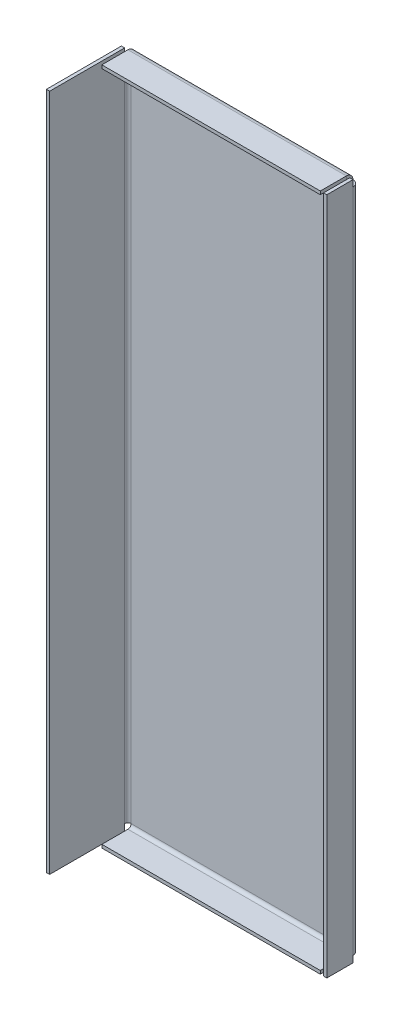
ISO-10303-21;
HEADER;
FILE_DESCRIPTION(('STEP AP214'),'2;1');
FILE_NAME('part.step','',(''),(''),'','','');
FILE_SCHEMA(('AUTOMOTIVE_DESIGN { 1 0 10303 214 1 1 1 1 }'));
ENDSEC;
DATA;
#1=APPLICATION_CONTEXT('core data for automotive mechanical design processes');
#2=APPLICATION_PROTOCOL_DEFINITION('international standard','automotive_design',2000,#1);
#3=PRODUCT_CONTEXT('',#1,'mechanical');
#4=PRODUCT('Part','Part','',(#3));
#5=PRODUCT_RELATED_PRODUCT_CATEGORY('part','',(#4));
#6=PRODUCT_DEFINITION_FORMATION('','',#4);
#7=PRODUCT_DEFINITION_CONTEXT('part definition',#1,'design');
#8=PRODUCT_DEFINITION('design','',#6,#7);
#9=PRODUCT_DEFINITION_SHAPE('','',#8);
#10=(LENGTH_UNIT() NAMED_UNIT(*) SI_UNIT(.MILLI.,.METRE.));
#11=(NAMED_UNIT(*) PLANE_ANGLE_UNIT() SI_UNIT($,.RADIAN.));
#12=(NAMED_UNIT(*) SI_UNIT($,.STERADIAN.) SOLID_ANGLE_UNIT());
#13=UNCERTAINTY_MEASURE_WITH_UNIT(LENGTH_MEASURE(1.E-05),#10,'distance_accuracy_value','');
#14=(GEOMETRIC_REPRESENTATION_CONTEXT(3) GLOBAL_UNCERTAINTY_ASSIGNED_CONTEXT((#13)) GLOBAL_UNIT_ASSIGNED_CONTEXT((#10,
#11,#12)) REPRESENTATION_CONTEXT('',''));
#15=CARTESIAN_POINT('',(0.,0.,0.));
#16=DIRECTION('',(0.,0.,1.));
#17=DIRECTION('',(1.,0.,0.));
#18=AXIS2_PLACEMENT_3D('',#15,#16,#17);
#19=CARTESIAN_POINT('',(0.,0.,-73.025));
#20=DIRECTION('',(0.,0.,-1.));
#21=DIRECTION('',(-1.,0.,0.));
#22=AXIS2_PLACEMENT_3D('',#19,#20,#21);
#23=PLANE('',#22);
#24=DIRECTION('',(-1.,0.,0.));
#25=VECTOR('',#24,1.);
#26=CARTESIAN_POINT('',(0.,6.34999999999997,-73.025));
#27=LINE('',#26,#25);
#28=CARTESIAN_POINT('',(0.,6.34999999999997,-73.025));
#29=VERTEX_POINT('',#28);
#30=CARTESIAN_POINT('',(-3.17500000000001,6.34999999999997,-73.025));
#31=VERTEX_POINT('',#30);
#32=EDGE_CURVE('E13',#29,#31,#27,.T.);
#33=ORIENTED_EDGE('',*,*,#32,.F.);
#34=DIRECTION('',(0.,1.,0.));
#35=VECTOR('',#34,1.);
#36=CARTESIAN_POINT('',(0.,660.4,-73.025));
#37=LINE('',#36,#35);
#38=CARTESIAN_POINT('',(0.,0.,-73.025));
#39=VERTEX_POINT('',#38);
#40=EDGE_CURVE('E449',#29,#39,#37,.F.);
#41=ORIENTED_EDGE('',*,*,#40,.T.);
#42=DIRECTION('',(-1.,0.,0.));
#43=VECTOR('',#42,1.);
#44=CARTESIAN_POINT('',(0.,0.,-73.025));
#45=LINE('',#44,#43);
#46=CARTESIAN_POINT('',(-3.175,0.,-73.025));
#47=VERTEX_POINT('',#46);
#48=EDGE_CURVE('E461',#39,#47,#45,.T.);
#49=ORIENTED_EDGE('',*,*,#48,.T.);
#50=DIRECTION('',(0.,1.,0.));
#51=VECTOR('',#50,1.);
#52=CARTESIAN_POINT('',(-3.17500000000001,660.4,-73.025));
#53=LINE('',#52,#51);
#54=EDGE_CURVE('E456',#31,#47,#53,.F.);
#55=ORIENTED_EDGE('',*,*,#54,.F.);
#56=EDGE_LOOP('',(#33,#41,#49,#55));
#57=FACE_BOUND('',#56,.T.);
#58=ADVANCED_FACE('F129',(#57),#23,.T.);
#59=CARTESIAN_POINT('',(3.17499999999999,660.4,-73.025));
#60=DIRECTION('',(0.,1.,0.));
#61=DIRECTION('',(0.,0.,-1.));
#62=AXIS2_PLACEMENT_3D('',#59,#60,#61);
#63=CYLINDRICAL_SURFACE('',#62,6.35);
#64=DIRECTION('',(0.,1.,0.));
#65=VECTOR('',#64,1.);
#66=CARTESIAN_POINT('',(3.17499999999998,0.,-79.375));
#67=LINE('',#66,#65);
#68=CARTESIAN_POINT('',(3.17499999999996,654.05,-79.3749999999998));
#69=VERTEX_POINT('',#68);
#70=CARTESIAN_POINT('',(3.17499999999996,6.35000000000001,-79.375));
#71=VERTEX_POINT('',#70);
#72=EDGE_CURVE('E446',#69,#71,#67,.F.);
#73=ORIENTED_EDGE('',*,*,#72,.T.);
#74=CARTESIAN_POINT('',(3.17499999999999,6.34999999999997,-73.025));
#75=DIRECTION('',(0.,-1.,0.));
#76=DIRECTION('',(0.,0.,-1.));
#77=AXIS2_PLACEMENT_3D('',#74,#75,#76);
#78=CIRCLE('',#77,6.35);
#79=EDGE_CURVE('E136',#71,#31,#78,.F.);
#80=ORIENTED_EDGE('',*,*,#79,.T.);
#81=CARTESIAN_POINT('',(-3.17500000000001,654.05,-73.025));
#82=VERTEX_POINT('',#81);
#83=EDGE_CURVE('E455',#82,#31,#53,.F.);
#84=ORIENTED_EDGE('',*,*,#83,.F.);
#85=CARTESIAN_POINT('',(3.17499999999999,654.05,-73.025));
#86=DIRECTION('',(0.,1.,0.));
#87=DIRECTION('',(0.,0.,1.));
#88=AXIS2_PLACEMENT_3D('',#85,#86,#87);
#89=CIRCLE('',#88,6.35);
#90=EDGE_CURVE('E495',#82,#69,#89,.F.);
#91=ORIENTED_EDGE('',*,*,#90,.T.);
#92=EDGE_LOOP('',(#73,#80,#84,#91));
#93=FACE_BOUND('',#92,.T.);
#94=ADVANCED_FACE('F513',(#93),#63,.T.);
#95=CARTESIAN_POINT('',(3.17499999999999,6.34999999999997,-73.025));
#96=DIRECTION('',(0.,-1.,0.));
#97=DIRECTION('',(0.,0.,-1.));
#98=AXIS2_PLACEMENT_3D('',#95,#96,#97);
#99=PLANE('',#98);
#100=CARTESIAN_POINT('',(3.17499999999999,6.34999999999997,-73.025));
#101=DIRECTION('',(0.,-1.,0.));
#102=DIRECTION('',(0.,0.,-1.));
#103=AXIS2_PLACEMENT_3D('',#100,#101,#102);
#104=CIRCLE('',#103,3.175);
#105=CARTESIAN_POINT('',(3.17499999999996,6.34999999999999,-76.1999999999999));
#106=VERTEX_POINT('',#105);
#107=EDGE_CURVE('E510',#106,#29,#104,.F.);
#108=ORIENTED_EDGE('',*,*,#107,.T.);
#109=ORIENTED_EDGE('',*,*,#32,.T.);
#110=ORIENTED_EDGE('',*,*,#79,.F.);
#111=DIRECTION('',(0.,0.,-1.));
#112=VECTOR('',#111,1.);
#113=CARTESIAN_POINT('',(3.17499999999996,6.34999999999999,-76.1999999999999));
#114=LINE('',#113,#112);
#115=EDGE_CURVE('E346',#106,#71,#114,.T.);
#116=ORIENTED_EDGE('',*,*,#115,.F.);
#117=EDGE_LOOP('',(#108,#109,#110,#116));
#118=FACE_BOUND('',#117,.T.);
#119=ADVANCED_FACE('F580',(#118),#99,.T.);
#120=CARTESIAN_POINT('',(-6.38378239159447E-13,0.,-73.0249999999989));
#121=DIRECTION('',(0.,0.,-1.));
#122=DIRECTION('',(-1.,0.,0.));
#123=AXIS2_PLACEMENT_3D('',#120,#121,#122);
#124=PLANE('',#123);
#125=DIRECTION('',(-1.,0.,0.));
#126=VECTOR('',#125,1.);
#127=CARTESIAN_POINT('',(222.25,6.34999999999999,-73.0250000000008));
#128=LINE('',#127,#126);
#129=CARTESIAN_POINT('',(222.25,6.34999999999999,-73.0250000000008));
#130=VERTEX_POINT('',#129);
#131=CARTESIAN_POINT('',(219.075,6.34999999999998,-73.0250000000008));
#132=VERTEX_POINT('',#131);
#133=EDGE_CURVE('E508',#130,#132,#128,.T.);
#134=ORIENTED_EDGE('',*,*,#133,.F.);
#135=DIRECTION('',(0.,1.,0.));
#136=VECTOR('',#135,1.);
#137=CARTESIAN_POINT('',(222.25,0.,-73.0250000000008));
#138=LINE('',#137,#136);
#139=CARTESIAN_POINT('',(222.25,0.,-73.0250000000008));
#140=VERTEX_POINT('',#139);
#141=EDGE_CURVE('E431',#130,#140,#138,.F.);
#142=ORIENTED_EDGE('',*,*,#141,.T.);
#143=DIRECTION('',(-1.,0.,0.));
#144=VECTOR('',#143,1.);
#145=CARTESIAN_POINT('',(222.25,0.,-73.0250000000008));
#146=LINE('',#145,#144);
#147=CARTESIAN_POINT('',(219.075,0.,-73.0250000000008));
#148=VERTEX_POINT('',#147);
#149=EDGE_CURVE('E403',#148,#140,#146,.F.);
#150=ORIENTED_EDGE('',*,*,#149,.F.);
#151=DIRECTION('',(0.,1.,0.));
#152=VECTOR('',#151,1.);
#153=CARTESIAN_POINT('',(219.075,0.,-73.0250000000008));
#154=LINE('',#153,#152);
#155=EDGE_CURVE('E434',#148,#132,#154,.T.);
#156=ORIENTED_EDGE('',*,*,#155,.T.);
#157=EDGE_LOOP('',(#134,#142,#150,#156));
#158=FACE_BOUND('',#157,.T.);
#159=ADVANCED_FACE('F585',(#158),#124,.T.);
#160=CARTESIAN_POINT('',(215.9,660.4,-73.0250000000008));
#161=DIRECTION('',(0.,1.,0.));
#162=DIRECTION('',(1.,0.,0.));
#163=AXIS2_PLACEMENT_3D('',#160,#161,#162);
#164=CYLINDRICAL_SURFACE('',#163,6.35000000000001);
#165=CARTESIAN_POINT('',(222.25,654.05,-73.0250000000008));
#166=VERTEX_POINT('',#165);
#167=EDGE_CURVE('E430',#166,#130,#138,.F.);
#168=ORIENTED_EDGE('',*,*,#167,.T.);
#169=CARTESIAN_POINT('',(215.9,6.34999999999997,-73.0250000000008));
#170=DIRECTION('',(0.,-1.,0.));
#171=DIRECTION('',(0.,0.,-1.));
#172=AXIS2_PLACEMENT_3D('',#169,#170,#171);
#173=CIRCLE('',#172,6.35000000000001);
#174=CARTESIAN_POINT('',(215.9,6.34999999999998,-79.3750000000009));
#175=VERTEX_POINT('',#174);
#176=EDGE_CURVE('E503',#130,#175,#173,.F.);
#177=ORIENTED_EDGE('',*,*,#176,.T.);
#178=DIRECTION('',(0.,1.,0.));
#179=VECTOR('',#178,1.);
#180=CARTESIAN_POINT('',(215.9,660.4,-79.3750000000008));
#181=LINE('',#180,#179);
#182=CARTESIAN_POINT('',(215.9,654.05,-79.3750000000008));
#183=VERTEX_POINT('',#182);
#184=EDGE_CURVE('E441',#183,#175,#181,.F.);
#185=ORIENTED_EDGE('',*,*,#184,.F.);
#186=CARTESIAN_POINT('',(215.9,654.05,-73.0250000000008));
#187=DIRECTION('',(0.,1.,0.));
#188=DIRECTION('',(0.,0.,1.));
#189=AXIS2_PLACEMENT_3D('',#186,#187,#188);
#190=CIRCLE('',#189,6.35000000000001);
#191=EDGE_CURVE('E490',#183,#166,#190,.F.);
#192=ORIENTED_EDGE('',*,*,#191,.T.);
#193=EDGE_LOOP('',(#168,#177,#185,#192));
#194=FACE_BOUND('',#193,.T.);
#195=ADVANCED_FACE('F630',(#194),#164,.T.);
#196=CARTESIAN_POINT('',(-2.88641209407116E-13,0.,-79.375));
#197=DIRECTION('',(0.,0.,1.));
#198=DIRECTION('',(1.,0.,0.));
#199=AXIS2_PLACEMENT_3D('',#196,#197,#198);
#200=PLANE('',#199);
#201=DIRECTION('',(1.,0.,0.));
#202=VECTOR('',#201,1.);
#203=CARTESIAN_POINT('',(215.9,6.34999999999998,-79.3750000000009));
#204=LINE('',#203,#202);
#205=EDGE_CURVE('E327',#175,#71,#204,.F.);
#206=ORIENTED_EDGE('',*,*,#205,.T.);
#207=ORIENTED_EDGE('',*,*,#72,.F.);
#208=DIRECTION('',(-1.,0.,0.));
#209=VECTOR('',#208,1.);
#210=CARTESIAN_POINT('',(3.17499999999997,654.05,-79.3749999999998));
#211=LINE('',#210,#209);
#212=EDGE_CURVE('E382',#69,#183,#211,.F.);
#213=ORIENTED_EDGE('',*,*,#212,.T.);
#214=ORIENTED_EDGE('',*,*,#184,.T.);
#215=EDGE_LOOP('',(#206,#207,#213,#214));
#216=FACE_BOUND('',#215,.T.);
#217=ADVANCED_FACE('F635',(#216),#200,.F.);
#218=CARTESIAN_POINT('',(-2.77555756156289E-13,0.,-76.2));
#219=DIRECTION('',(0.,0.,1.));
#220=DIRECTION('',(1.,0.,0.));
#221=AXIS2_PLACEMENT_3D('',#218,#219,#220);
#222=PLANE('',#221);
#223=DIRECTION('',(0.,1.,0.));
#224=VECTOR('',#223,1.);
#225=CARTESIAN_POINT('',(3.17499999999998,0.,-76.2));
#226=LINE('',#225,#224);
#227=CARTESIAN_POINT('',(3.17499999999998,654.05,-76.1999999999998));
#228=VERTEX_POINT('',#227);
#229=EDGE_CURVE('E443',#106,#228,#226,.T.);
#230=ORIENTED_EDGE('',*,*,#229,.F.);
#231=DIRECTION('',(1.,0.,0.));
#232=VECTOR('',#231,1.);
#233=CARTESIAN_POINT('',(215.9,6.34999999999999,-76.2000000000009));
#234=LINE('',#233,#232);
#235=CARTESIAN_POINT('',(215.9,6.34999999999999,-76.2000000000009));
#236=VERTEX_POINT('',#235);
#237=EDGE_CURVE('E340',#236,#106,#234,.F.);
#238=ORIENTED_EDGE('',*,*,#237,.F.);
#239=DIRECTION('',(0.,1.,0.));
#240=VECTOR('',#239,1.);
#241=CARTESIAN_POINT('',(215.9,660.4,-76.2000000000008));
#242=LINE('',#241,#240);
#243=CARTESIAN_POINT('',(215.9,654.05,-76.2000000000008));
#244=VERTEX_POINT('',#243);
#245=EDGE_CURVE('E409',#244,#236,#242,.F.);
#246=ORIENTED_EDGE('',*,*,#245,.F.);
#247=DIRECTION('',(-1.,0.,0.));
#248=VECTOR('',#247,1.);
#249=CARTESIAN_POINT('',(3.17499999999998,654.05,-76.1999999999998));
#250=LINE('',#249,#248);
#251=EDGE_CURVE('E395',#228,#244,#250,.F.);
#252=ORIENTED_EDGE('',*,*,#251,.F.);
#253=EDGE_LOOP('',(#230,#238,#246,#252));
#254=FACE_BOUND('',#253,.T.);
#255=ADVANCED_FACE('F588',(#254),#222,.T.);
#256=CARTESIAN_POINT('',(0.,0.,-73.025));
#257=DIRECTION('',(0.,0.,1.));
#258=DIRECTION('',(1.,0.,0.));
#259=AXIS2_PLACEMENT_3D('',#256,#257,#258);
#260=PLANE('',#259);
#261=DIRECTION('',(1.,0.,0.));
#262=VECTOR('',#261,1.);
#263=CARTESIAN_POINT('',(-3.17500000000001,654.05,-73.025));
#264=LINE('',#263,#262);
#265=CARTESIAN_POINT('',(0.,654.05,-73.025));
#266=VERTEX_POINT('',#265);
#267=EDGE_CURVE('E501',#82,#266,#264,.T.);
#268=ORIENTED_EDGE('',*,*,#267,.F.);
#269=CARTESIAN_POINT('',(-3.17500000000001,660.4,-73.025));
#270=VERTEX_POINT('',#269);
#271=EDGE_CURVE('E451',#270,#82,#53,.F.);
#272=ORIENTED_EDGE('',*,*,#271,.F.);
#273=DIRECTION('',(-1.,0.,0.));
#274=VECTOR('',#273,1.);
#275=CARTESIAN_POINT('',(0.,660.4,-73.025));
#276=LINE('',#275,#274);
#277=CARTESIAN_POINT('',(0.,660.4,-73.025));
#278=VERTEX_POINT('',#277);
#279=EDGE_CURVE('E454',#278,#270,#276,.T.);
#280=ORIENTED_EDGE('',*,*,#279,.F.);
#281=EDGE_CURVE('E457',#278,#266,#37,.F.);
#282=ORIENTED_EDGE('',*,*,#281,.T.);
#283=EDGE_LOOP('',(#268,#272,#280,#282));
#284=FACE_BOUND('',#283,.T.);
#285=ADVANCED_FACE('F524',(#284),#260,.F.);
#286=CARTESIAN_POINT('',(-6.38378239159447E-13,0.,-73.0249999999989));
#287=DIRECTION('',(0.,0.,1.));
#288=DIRECTION('',(1.,0.,0.));
#289=AXIS2_PLACEMENT_3D('',#286,#287,#288);
#290=PLANE('',#289);
#291=DIRECTION('',(1.,0.,0.));
#292=VECTOR('',#291,1.);
#293=CARTESIAN_POINT('',(219.075,654.05,-73.0250000000008));
#294=LINE('',#293,#292);
#295=CARTESIAN_POINT('',(219.075,654.05,-73.0250000000008));
#296=VERTEX_POINT('',#295);
#297=EDGE_CURVE('E493',#296,#166,#294,.T.);
#298=ORIENTED_EDGE('',*,*,#297,.F.);
#299=CARTESIAN_POINT('',(219.075,660.4,-73.0250000000008));
#300=VERTEX_POINT('',#299);
#301=EDGE_CURVE('E438',#296,#300,#154,.T.);
#302=ORIENTED_EDGE('',*,*,#301,.T.);
#303=DIRECTION('',(-1.,0.,0.));
#304=VECTOR('',#303,1.);
#305=CARTESIAN_POINT('',(219.075,660.4,-73.0250000000008));
#306=LINE('',#305,#304);
#307=CARTESIAN_POINT('',(222.25,660.4,-73.0250000000008));
#308=VERTEX_POINT('',#307);
#309=EDGE_CURVE('E432',#300,#308,#306,.F.);
#310=ORIENTED_EDGE('',*,*,#309,.T.);
#311=EDGE_CURVE('E427',#308,#166,#138,.F.);
#312=ORIENTED_EDGE('',*,*,#311,.T.);
#313=EDGE_LOOP('',(#298,#302,#310,#312));
#314=FACE_BOUND('',#313,.T.);
#315=ADVANCED_FACE('F618',(#314),#290,.F.);
#316=CARTESIAN_POINT('',(215.9,6.34999999999997,-73.0250000000008));
#317=DIRECTION('',(0.,-1.,0.));
#318=DIRECTION('',(0.,0.,-1.));
#319=AXIS2_PLACEMENT_3D('',#316,#317,#318);
#320=PLANE('',#319);
#321=ORIENTED_EDGE('',*,*,#176,.F.);
#322=ORIENTED_EDGE('',*,*,#133,.T.);
#323=CARTESIAN_POINT('',(215.9,6.34999999999997,-73.0250000000008));
#324=DIRECTION('',(0.,-1.,0.));
#325=DIRECTION('',(0.,0.,-1.));
#326=AXIS2_PLACEMENT_3D('',#323,#324,#325);
#327=CIRCLE('',#326,3.17500000000001);
#328=EDGE_CURVE('E506',#132,#236,#327,.F.);
#329=ORIENTED_EDGE('',*,*,#328,.T.);
#330=DIRECTION('',(0.,0.,-1.));
#331=VECTOR('',#330,1.);
#332=CARTESIAN_POINT('',(215.9,6.34999999999999,-76.2000000000009));
#333=LINE('',#332,#331);
#334=EDGE_CURVE('E334',#236,#175,#333,.T.);
#335=ORIENTED_EDGE('',*,*,#334,.T.);
#336=EDGE_LOOP('',(#321,#322,#329,#335));
#337=FACE_BOUND('',#336,.T.);
#338=ADVANCED_FACE('F616',(#337),#320,.T.);
#339=CARTESIAN_POINT('',(215.9,654.05,-73.0250000000008));
#340=DIRECTION('',(0.,1.,0.));
#341=DIRECTION('',(0.,0.,1.));
#342=AXIS2_PLACEMENT_3D('',#339,#340,#341);
#343=PLANE('',#342);
#344=CARTESIAN_POINT('',(215.9,654.05,-73.0250000000008));
#345=DIRECTION('',(0.,1.,0.));
#346=DIRECTION('',(0.,0.,1.));
#347=AXIS2_PLACEMENT_3D('',#344,#345,#346);
#348=CIRCLE('',#347,3.17500000000001);
#349=EDGE_CURVE('E485',#244,#296,#348,.F.);
#350=ORIENTED_EDGE('',*,*,#349,.T.);
#351=ORIENTED_EDGE('',*,*,#297,.T.);
#352=ORIENTED_EDGE('',*,*,#191,.F.);
#353=DIRECTION('',(0.,0.,-1.));
#354=VECTOR('',#353,1.);
#355=CARTESIAN_POINT('',(215.9,654.05,-76.2000000000008));
#356=LINE('',#355,#354);
#357=EDGE_CURVE('E400',#244,#183,#356,.T.);
#358=ORIENTED_EDGE('',*,*,#357,.F.);
#359=EDGE_LOOP('',(#350,#351,#352,#358));
#360=FACE_BOUND('',#359,.T.);
#361=ADVANCED_FACE('F609',(#360),#343,.T.);
#362=CARTESIAN_POINT('',(-3.175,660.4,0.));
#363=DIRECTION('',(0.,1.,0.));
#364=DIRECTION('',(0.,0.,1.));
#365=AXIS2_PLACEMENT_3D('',#362,#363,#364);
#366=PLANE('',#365);
#367=DIRECTION('',(0.,0.,1.));
#368=VECTOR('',#367,1.);
#369=CARTESIAN_POINT('',(0.,660.4,0.));
#370=LINE('',#369,#368);
#371=CARTESIAN_POINT('',(0.,660.4,0.));
#372=VERTEX_POINT('',#371);
#373=EDGE_CURVE('E479',#278,#372,#370,.T.);
#374=ORIENTED_EDGE('',*,*,#373,.F.);
#375=ORIENTED_EDGE('',*,*,#279,.T.);
#376=DIRECTION('',(0.,0.,1.));
#377=VECTOR('',#376,1.);
#378=CARTESIAN_POINT('',(-3.175,660.4,0.));
#379=LINE('',#378,#377);
#380=CARTESIAN_POINT('',(-3.175,660.4,0.));
#381=VERTEX_POINT('',#380);
#382=EDGE_CURVE('E470',#270,#381,#379,.T.);
#383=ORIENTED_EDGE('',*,*,#382,.T.);
#384=DIRECTION('',(1.,0.,0.));
#385=VECTOR('',#384,1.);
#386=CARTESIAN_POINT('',(-3.175,660.4,0.));
#387=LINE('',#386,#385);
#388=EDGE_CURVE('E476',#381,#372,#387,.T.);
#389=ORIENTED_EDGE('',*,*,#388,.T.);
#390=EDGE_LOOP('',(#374,#375,#383,#389));
#391=FACE_BOUND('',#390,.T.);
#392=ADVANCED_FACE('F598',(#391),#366,.T.);
#393=CARTESIAN_POINT('',(-3.175,0.,0.));
#394=DIRECTION('',(1.,0.,0.));
#395=DIRECTION('',(0.,0.,-1.));
#396=AXIS2_PLACEMENT_3D('',#393,#394,#395);
#397=PLANE('',#396);
#398=ORIENTED_EDGE('',*,*,#271,.T.);
#399=ORIENTED_EDGE('',*,*,#83,.T.);
#400=ORIENTED_EDGE('',*,*,#54,.T.);
#401=DIRECTION('',(0.,0.,-1.));
#402=VECTOR('',#401,1.);
#403=CARTESIAN_POINT('',(-3.175,0.,0.));
#404=LINE('',#403,#402);
#405=CARTESIAN_POINT('',(-3.175,0.,0.));
#406=VERTEX_POINT('',#405);
#407=EDGE_CURVE('E467',#406,#47,#404,.T.);
#408=ORIENTED_EDGE('',*,*,#407,.F.);
#409=DIRECTION('',(0.,-1.,0.));
#410=VECTOR('',#409,1.);
#411=CARTESIAN_POINT('',(-3.175,0.,0.));
#412=LINE('',#411,#410);
#413=EDGE_CURVE('E473',#381,#406,#412,.T.);
#414=ORIENTED_EDGE('',*,*,#413,.F.);
#415=ORIENTED_EDGE('',*,*,#382,.F.);
#416=EDGE_LOOP('',(#398,#399,#400,#408,#414,#415));
#417=FACE_BOUND('',#416,.T.);
#418=ADVANCED_FACE('F519',(#417),#397,.F.);
#419=CARTESIAN_POINT('',(0.,0.,0.));
#420=DIRECTION('',(1.,0.,0.));
#421=DIRECTION('',(0.,0.,-1.));
#422=AXIS2_PLACEMENT_3D('',#419,#420,#421);
#423=PLANE('',#422);
#424=DIRECTION('',(0.,0.,-1.));
#425=VECTOR('',#424,1.);
#426=CARTESIAN_POINT('',(0.,0.,0.));
#427=LINE('',#426,#425);
#428=CARTESIAN_POINT('',(0.,0.,0.));
#429=VERTEX_POINT('',#428);
#430=EDGE_CURVE('E464',#429,#39,#427,.T.);
#431=ORIENTED_EDGE('',*,*,#430,.T.);
#432=ORIENTED_EDGE('',*,*,#40,.F.);
#433=EDGE_CURVE('E460',#266,#29,#37,.F.);
#434=ORIENTED_EDGE('',*,*,#433,.F.);
#435=ORIENTED_EDGE('',*,*,#281,.F.);
#436=ORIENTED_EDGE('',*,*,#373,.T.);
#437=DIRECTION('',(0.,-1.,0.));
#438=VECTOR('',#437,1.);
#439=CARTESIAN_POINT('',(0.,0.,0.));
#440=LINE('',#439,#438);
#441=EDGE_CURVE('E471',#372,#429,#440,.T.);
#442=ORIENTED_EDGE('',*,*,#441,.T.);
#443=EDGE_LOOP('',(#431,#432,#434,#435,#436,#442));
#444=FACE_BOUND('',#443,.T.);
#445=ADVANCED_FACE('F597',(#444),#423,.T.);
#446=CARTESIAN_POINT('',(-3.175,0.,0.));
#447=DIRECTION('',(0.,-1.,0.));
#448=DIRECTION('',(0.,0.,-1.));
#449=AXIS2_PLACEMENT_3D('',#446,#447,#448);
#450=PLANE('',#449);
#451=ORIENTED_EDGE('',*,*,#48,.F.);
#452=ORIENTED_EDGE('',*,*,#430,.F.);
#453=DIRECTION('',(1.,0.,0.));
#454=VECTOR('',#453,1.);
#455=CARTESIAN_POINT('',(-3.175,0.,0.));
#456=LINE('',#455,#454);
#457=EDGE_CURVE('E483',#406,#429,#456,.T.);
#458=ORIENTED_EDGE('',*,*,#457,.F.);
#459=ORIENTED_EDGE('',*,*,#407,.T.);
#460=EDGE_LOOP('',(#451,#452,#458,#459));
#461=FACE_BOUND('',#460,.T.);
#462=ADVANCED_FACE('F601',(#461),#450,.T.);
#463=CARTESIAN_POINT('',(-3.175,0.,0.));
#464=DIRECTION('',(0.,0.,1.));
#465=DIRECTION('',(1.,0.,0.));
#466=AXIS2_PLACEMENT_3D('',#463,#464,#465);
#467=PLANE('',#466);
#468=ORIENTED_EDGE('',*,*,#441,.F.);
#469=ORIENTED_EDGE('',*,*,#388,.F.);
#470=ORIENTED_EDGE('',*,*,#413,.T.);
#471=ORIENTED_EDGE('',*,*,#457,.T.);
#472=EDGE_LOOP('',(#468,#469,#470,#471));
#473=FACE_BOUND('',#472,.T.);
#474=ADVANCED_FACE('F603',(#473),#467,.T.);
#475=CARTESIAN_POINT('',(3.17499999999999,654.05,-73.025));
#476=DIRECTION('',(0.,1.,0.));
#477=DIRECTION('',(0.,0.,1.));
#478=AXIS2_PLACEMENT_3D('',#475,#476,#477);
#479=PLANE('',#478);
#480=ORIENTED_EDGE('',*,*,#90,.F.);
#481=ORIENTED_EDGE('',*,*,#267,.T.);
#482=CARTESIAN_POINT('',(3.17499999999999,654.05,-73.025));
#483=DIRECTION('',(0.,1.,0.));
#484=DIRECTION('',(0.,0.,1.));
#485=AXIS2_PLACEMENT_3D('',#482,#483,#484);
#486=CIRCLE('',#485,3.175);
#487=EDGE_CURVE('E498',#266,#228,#486,.F.);
#488=ORIENTED_EDGE('',*,*,#487,.T.);
#489=DIRECTION('',(0.,0.,-1.));
#490=VECTOR('',#489,1.);
#491=CARTESIAN_POINT('',(3.17499999999998,654.05,-76.1999999999998));
#492=LINE('',#491,#490);
#493=EDGE_CURVE('E389',#228,#69,#492,.T.);
#494=ORIENTED_EDGE('',*,*,#493,.T.);
#495=EDGE_LOOP('',(#480,#481,#488,#494));
#496=FACE_BOUND('',#495,.T.);
#497=ADVANCED_FACE('F528',(#496),#479,.T.);
#498=CARTESIAN_POINT('',(3.17499999999999,660.4,-73.025));
#499=DIRECTION('',(0.,1.,0.));
#500=DIRECTION('',(0.,0.,-1.));
#501=AXIS2_PLACEMENT_3D('',#498,#499,#500);
#502=CYLINDRICAL_SURFACE('',#501,3.175);
#503=ORIENTED_EDGE('',*,*,#107,.F.);
#504=ORIENTED_EDGE('',*,*,#229,.T.);
#505=ORIENTED_EDGE('',*,*,#487,.F.);
#506=ORIENTED_EDGE('',*,*,#433,.T.);
#507=EDGE_LOOP('',(#503,#504,#505,#506));
#508=FACE_BOUND('',#507,.T.);
#509=ADVANCED_FACE('F590',(#508),#502,.F.);
#510=CARTESIAN_POINT('',(215.9,660.4,-73.0250000000008));
#511=DIRECTION('',(0.,1.,0.));
#512=DIRECTION('',(1.,0.,0.));
#513=AXIS2_PLACEMENT_3D('',#510,#511,#512);
#514=CYLINDRICAL_SURFACE('',#513,3.17500000000001);
#515=ORIENTED_EDGE('',*,*,#328,.F.);
#516=EDGE_CURVE('E437',#132,#296,#154,.T.);
#517=ORIENTED_EDGE('',*,*,#516,.T.);
#518=ORIENTED_EDGE('',*,*,#349,.F.);
#519=ORIENTED_EDGE('',*,*,#245,.T.);
#520=EDGE_LOOP('',(#515,#517,#518,#519));
#521=FACE_BOUND('',#520,.T.);
#522=ADVANCED_FACE('F593',(#521),#514,.F.);
#523=CARTESIAN_POINT('',(222.25,660.4,-47.6250000000008));
#524=DIRECTION('',(0.,-1.,0.));
#525=DIRECTION('',(0.,0.,-1.));
#526=AXIS2_PLACEMENT_3D('',#523,#524,#525);
#527=PLANE('',#526);
#528=ORIENTED_EDGE('',*,*,#309,.F.);
#529=DIRECTION('',(0.,0.,-1.));
#530=VECTOR('',#529,1.);
#531=CARTESIAN_POINT('',(219.075,660.4,-47.6250000000008));
#532=LINE('',#531,#530);
#533=CARTESIAN_POINT('',(219.075,660.4,-47.6250000000008));
#534=VERTEX_POINT('',#533);
#535=EDGE_CURVE('E425',#300,#534,#532,.F.);
#536=ORIENTED_EDGE('',*,*,#535,.T.);
#537=DIRECTION('',(-1.,0.,0.));
#538=VECTOR('',#537,1.);
#539=CARTESIAN_POINT('',(222.25,660.4,-47.6250000000008));
#540=LINE('',#539,#538);
#541=CARTESIAN_POINT('',(222.25,660.4,-47.6250000000008));
#542=VERTEX_POINT('',#541);
#543=EDGE_CURVE('E406',#542,#534,#540,.T.);
#544=ORIENTED_EDGE('',*,*,#543,.F.);
#545=DIRECTION('',(0.,0.,1.));
#546=VECTOR('',#545,1.);
#547=CARTESIAN_POINT('',(222.250000000001,660.4,-1.52222234787952E-12));
#548=LINE('',#547,#546);
#549=EDGE_CURVE('E418',#308,#542,#548,.T.);
#550=ORIENTED_EDGE('',*,*,#549,.F.);
#551=EDGE_LOOP('',(#528,#536,#544,#550));
#552=FACE_BOUND('',#551,.T.);
#553=ADVANCED_FACE('F658',(#552),#527,.F.);
#554=CARTESIAN_POINT('',(222.25,0.,-76.2000000000008));
#555=DIRECTION('',(0.,1.,0.));
#556=DIRECTION('',(0.,0.,1.));
#557=AXIS2_PLACEMENT_3D('',#554,#555,#556);
#558=PLANE('',#557);
#559=ORIENTED_EDGE('',*,*,#149,.T.);
#560=DIRECTION('',(0.,0.,-1.));
#561=VECTOR('',#560,1.);
#562=CARTESIAN_POINT('',(222.250000000001,0.,-1.52222234787952E-12));
#563=LINE('',#562,#561);
#564=CARTESIAN_POINT('',(222.25,0.,-47.6250000000008));
#565=VERTEX_POINT('',#564);
#566=EDGE_CURVE('E413',#565,#140,#563,.T.);
#567=ORIENTED_EDGE('',*,*,#566,.F.);
#568=DIRECTION('',(-1.,0.,0.));
#569=VECTOR('',#568,1.);
#570=CARTESIAN_POINT('',(222.25,0.,-47.6250000000008));
#571=LINE('',#570,#569);
#572=CARTESIAN_POINT('',(219.075,0.,-47.6250000000008));
#573=VERTEX_POINT('',#572);
#574=EDGE_CURVE('E410',#565,#573,#571,.T.);
#575=ORIENTED_EDGE('',*,*,#574,.T.);
#576=DIRECTION('',(0.,0.,1.));
#577=VECTOR('',#576,1.);
#578=CARTESIAN_POINT('',(219.075,0.,-76.2000000000008));
#579=LINE('',#578,#577);
#580=EDGE_CURVE('E420',#573,#148,#579,.F.);
#581=ORIENTED_EDGE('',*,*,#580,.T.);
#582=EDGE_LOOP('',(#559,#567,#575,#581));
#583=FACE_BOUND('',#582,.T.);
#584=ADVANCED_FACE('F667',(#583),#558,.F.);
#585=CARTESIAN_POINT('',(222.250000000001,0.,-1.52222234787952E-12));
#586=DIRECTION('',(-1.,0.,0.));
#587=DIRECTION('',(0.,0.,1.));
#588=AXIS2_PLACEMENT_3D('',#585,#586,#587);
#589=PLANE('',#588);
#590=ORIENTED_EDGE('',*,*,#311,.F.);
#591=ORIENTED_EDGE('',*,*,#549,.T.);
#592=DIRECTION('',(0.,-1.,0.));
#593=VECTOR('',#592,1.);
#594=CARTESIAN_POINT('',(222.25,0.,-47.6250000000008));
#595=LINE('',#594,#593);
#596=EDGE_CURVE('E416',#542,#565,#595,.T.);
#597=ORIENTED_EDGE('',*,*,#596,.T.);
#598=ORIENTED_EDGE('',*,*,#566,.T.);
#599=ORIENTED_EDGE('',*,*,#141,.F.);
#600=ORIENTED_EDGE('',*,*,#167,.F.);
#601=EDGE_LOOP('',(#590,#591,#597,#598,#599,#600));
#602=FACE_BOUND('',#601,.T.);
#603=ADVANCED_FACE('F648',(#602),#589,.F.);
#604=CARTESIAN_POINT('',(219.075000000001,0.,-1.50003466438244E-12));
#605=DIRECTION('',(-1.,0.,0.));
#606=DIRECTION('',(0.,0.,1.));
#607=AXIS2_PLACEMENT_3D('',#604,#605,#606);
#608=PLANE('',#607);
#609=ORIENTED_EDGE('',*,*,#535,.F.);
#610=ORIENTED_EDGE('',*,*,#301,.F.);
#611=ORIENTED_EDGE('',*,*,#516,.F.);
#612=ORIENTED_EDGE('',*,*,#155,.F.);
#613=ORIENTED_EDGE('',*,*,#580,.F.);
#614=DIRECTION('',(0.,1.,0.));
#615=VECTOR('',#614,1.);
#616=CARTESIAN_POINT('',(219.075,0.,-47.6250000000008));
#617=LINE('',#616,#615);
#618=EDGE_CURVE('E423',#534,#573,#617,.F.);
#619=ORIENTED_EDGE('',*,*,#618,.F.);
#620=EDGE_LOOP('',(#609,#610,#611,#612,#613,#619));
#621=FACE_BOUND('',#620,.T.);
#622=ADVANCED_FACE('F670',(#621),#608,.T.);
#623=CARTESIAN_POINT('',(222.25,0.,-47.6250000000008));
#624=DIRECTION('',(0.,0.,-1.));
#625=DIRECTION('',(-1.,0.,0.));
#626=AXIS2_PLACEMENT_3D('',#623,#624,#625);
#627=PLANE('',#626);
#628=ORIENTED_EDGE('',*,*,#618,.T.);
#629=ORIENTED_EDGE('',*,*,#574,.F.);
#630=ORIENTED_EDGE('',*,*,#596,.F.);
#631=ORIENTED_EDGE('',*,*,#543,.T.);
#632=EDGE_LOOP('',(#628,#629,#630,#631));
#633=FACE_BOUND('',#632,.T.);
#634=ADVANCED_FACE('F664',(#633),#627,.F.);
#635=CARTESIAN_POINT('',(215.9,654.05,-73.0250000000007));
#636=DIRECTION('',(1.,0.,0.));
#637=DIRECTION('',(0.,0.,-1.));
#638=AXIS2_PLACEMENT_3D('',#635,#636,#637);
#639=PLANE('',#638);
#640=DIRECTION('',(0.,-1.,0.));
#641=VECTOR('',#640,1.);
#642=CARTESIAN_POINT('',(215.9,660.4,-73.0250000000007));
#643=LINE('',#642,#641);
#644=CARTESIAN_POINT('',(215.9,657.225,-73.0250000000008));
#645=VERTEX_POINT('',#644);
#646=CARTESIAN_POINT('',(215.9,660.4,-73.0250000000008));
#647=VERTEX_POINT('',#646);
#648=EDGE_CURVE('E349',#645,#647,#643,.F.);
#649=ORIENTED_EDGE('',*,*,#648,.F.);
#650=CARTESIAN_POINT('',(215.9,654.05,-73.0250000000007));
#651=DIRECTION('',(-1.,0.,0.));
#652=DIRECTION('',(0.,0.,1.));
#653=AXIS2_PLACEMENT_3D('',#650,#651,#652);
#654=CIRCLE('',#653,3.17500000000004);
#655=EDGE_CURVE('E392',#244,#645,#654,.F.);
#656=ORIENTED_EDGE('',*,*,#655,.F.);
#657=ORIENTED_EDGE('',*,*,#357,.T.);
#658=CARTESIAN_POINT('',(215.9,654.05,-73.0250000000007));
#659=DIRECTION('',(-1.,0.,0.));
#660=DIRECTION('',(0.,0.,1.));
#661=AXIS2_PLACEMENT_3D('',#658,#659,#660);
#662=CIRCLE('',#661,6.35000000000004);
#663=EDGE_CURVE('E385',#183,#647,#662,.F.);
#664=ORIENTED_EDGE('',*,*,#663,.T.);
#665=EDGE_LOOP('',(#649,#656,#657,#664));
#666=FACE_BOUND('',#665,.T.);
#667=ADVANCED_FACE('F559',(#666),#639,.T.);
#668=CARTESIAN_POINT('',(3.17499999999999,654.05,-73.0249999999998));
#669=DIRECTION('',(1.,0.,0.));
#670=DIRECTION('',(0.,0.,-1.));
#671=AXIS2_PLACEMENT_3D('',#668,#669,#670);
#672=PLANE('',#671);
#673=CARTESIAN_POINT('',(3.17499999999999,654.05,-73.0249999999998));
#674=DIRECTION('',(-1.,0.,0.));
#675=DIRECTION('',(0.,0.,1.));
#676=AXIS2_PLACEMENT_3D('',#673,#674,#675);
#677=CIRCLE('',#676,3.17500000000004);
#678=CARTESIAN_POINT('',(3.17499999999999,657.225,-73.0249999999998));
#679=VERTEX_POINT('',#678);
#680=EDGE_CURVE('E355',#679,#228,#677,.T.);
#681=ORIENTED_EDGE('',*,*,#680,.F.);
#682=DIRECTION('',(0.,-1.,0.));
#683=VECTOR('',#682,1.);
#684=CARTESIAN_POINT('',(3.17499999999998,657.225,-73.0249999999999));
#685=LINE('',#684,#683);
#686=CARTESIAN_POINT('',(3.17499999999999,660.4,-73.0249999999999));
#687=VERTEX_POINT('',#686);
#688=EDGE_CURVE('E375',#679,#687,#685,.F.);
#689=ORIENTED_EDGE('',*,*,#688,.T.);
#690=CARTESIAN_POINT('',(3.17499999999999,654.05,-73.0249999999998));
#691=DIRECTION('',(-1.,0.,0.));
#692=DIRECTION('',(0.,0.,1.));
#693=AXIS2_PLACEMENT_3D('',#690,#691,#692);
#694=CIRCLE('',#693,6.35000000000004);
#695=EDGE_CURVE('E386',#687,#69,#694,.T.);
#696=ORIENTED_EDGE('',*,*,#695,.T.);
#697=ORIENTED_EDGE('',*,*,#493,.F.);
#698=EDGE_LOOP('',(#681,#689,#696,#697));
#699=FACE_BOUND('',#698,.T.);
#700=ADVANCED_FACE('F538',(#699),#672,.F.);
#701=CARTESIAN_POINT('',(3.175,654.05,-73.0249999999998));
#702=DIRECTION('',(-1.,0.,0.));
#703=DIRECTION('',(0.,1.,0.));
#704=AXIS2_PLACEMENT_3D('',#701,#702,#703);
#705=CYLINDRICAL_SURFACE('',#704,6.35000000000004);
#706=ORIENTED_EDGE('',*,*,#212,.F.);
#707=ORIENTED_EDGE('',*,*,#695,.F.);
#708=DIRECTION('',(-1.,0.,0.));
#709=VECTOR('',#708,1.);
#710=CARTESIAN_POINT('',(215.9,660.4,-73.0250000000007));
#711=LINE('',#710,#709);
#712=EDGE_CURVE('E373',#687,#647,#711,.F.);
#713=ORIENTED_EDGE('',*,*,#712,.T.);
#714=ORIENTED_EDGE('',*,*,#663,.F.);
#715=EDGE_LOOP('',(#706,#707,#713,#714));
#716=FACE_BOUND('',#715,.T.);
#717=ADVANCED_FACE('F533',(#716),#705,.T.);
#718=CARTESIAN_POINT('',(3.175,654.05,-73.0249999999998));
#719=DIRECTION('',(-1.,0.,0.));
#720=DIRECTION('',(0.,1.,0.));
#721=AXIS2_PLACEMENT_3D('',#718,#719,#720);
#722=CYLINDRICAL_SURFACE('',#721,3.17500000000004);
#723=ORIENTED_EDGE('',*,*,#251,.T.);
#724=ORIENTED_EDGE('',*,*,#655,.T.);
#725=DIRECTION('',(-1.,0.,0.));
#726=VECTOR('',#725,1.);
#727=CARTESIAN_POINT('',(215.9,657.225,-73.0250000000007));
#728=LINE('',#727,#726);
#729=EDGE_CURVE('E378',#645,#679,#728,.T.);
#730=ORIENTED_EDGE('',*,*,#729,.T.);
#731=ORIENTED_EDGE('',*,*,#680,.T.);
#732=EDGE_LOOP('',(#723,#724,#730,#731));
#733=FACE_BOUND('',#732,.T.);
#734=ADVANCED_FACE('F562',(#733),#722,.F.);
#735=CARTESIAN_POINT('',(3.1750000000001,660.4,-47.625));
#736=DIRECTION('',(1.,0.,0.));
#737=DIRECTION('',(0.,0.,-1.));
#738=AXIS2_PLACEMENT_3D('',#735,#736,#737);
#739=PLANE('',#738);
#740=ORIENTED_EDGE('',*,*,#688,.F.);
#741=DIRECTION('',(0.,0.,-1.));
#742=VECTOR('',#741,1.);
#743=CARTESIAN_POINT('',(3.1750000000001,657.225,-47.625));
#744=LINE('',#743,#742);
#745=CARTESIAN_POINT('',(3.1750000000001,657.225,-47.625));
#746=VERTEX_POINT('',#745);
#747=EDGE_CURVE('E371',#679,#746,#744,.F.);
#748=ORIENTED_EDGE('',*,*,#747,.T.);
#749=DIRECTION('',(0.,-1.,0.));
#750=VECTOR('',#749,1.);
#751=CARTESIAN_POINT('',(3.17500000000009,660.4,-47.625));
#752=LINE('',#751,#750);
#753=CARTESIAN_POINT('',(3.1750000000001,660.4,-47.625));
#754=VERTEX_POINT('',#753);
#755=EDGE_CURVE('E352',#754,#746,#752,.T.);
#756=ORIENTED_EDGE('',*,*,#755,.F.);
#757=DIRECTION('',(0.,0.,1.));
#758=VECTOR('',#757,1.);
#759=CARTESIAN_POINT('',(3.1750000000003,660.4,-2.59013739439612E-12));
#760=LINE('',#759,#758);
#761=EDGE_CURVE('E364',#687,#754,#760,.T.);
#762=ORIENTED_EDGE('',*,*,#761,.F.);
#763=EDGE_LOOP('',(#740,#748,#756,#762));
#764=FACE_BOUND('',#763,.T.);
#765=ADVANCED_FACE('F549',(#764),#739,.F.);
#766=CARTESIAN_POINT('',(215.9,660.4,-76.2000000000008));
#767=DIRECTION('',(-1.,0.,0.));
#768=DIRECTION('',(0.,0.,1.));
#769=AXIS2_PLACEMENT_3D('',#766,#767,#768);
#770=PLANE('',#769);
#771=ORIENTED_EDGE('',*,*,#648,.T.);
#772=DIRECTION('',(0.,0.,-1.));
#773=VECTOR('',#772,1.);
#774=CARTESIAN_POINT('',(215.9,660.4,-3.41576939543464E-12));
#775=LINE('',#774,#773);
#776=CARTESIAN_POINT('',(215.9,660.4,-47.6250000000007));
#777=VERTEX_POINT('',#776);
#778=EDGE_CURVE('E359',#777,#647,#775,.T.);
#779=ORIENTED_EDGE('',*,*,#778,.F.);
#780=DIRECTION('',(0.,-1.,0.));
#781=VECTOR('',#780,1.);
#782=CARTESIAN_POINT('',(215.9,660.4,-47.6250000000007));
#783=LINE('',#782,#781);
#784=CARTESIAN_POINT('',(215.9,657.225,-47.6250000000007));
#785=VERTEX_POINT('',#784);
#786=EDGE_CURVE('E356',#777,#785,#783,.T.);
#787=ORIENTED_EDGE('',*,*,#786,.T.);
#788=DIRECTION('',(0.,0.,1.));
#789=VECTOR('',#788,1.);
#790=CARTESIAN_POINT('',(215.9,657.225,-76.2000000000008));
#791=LINE('',#790,#789);
#792=EDGE_CURVE('E366',#785,#645,#791,.F.);
#793=ORIENTED_EDGE('',*,*,#792,.T.);
#794=EDGE_LOOP('',(#771,#779,#787,#793));
#795=FACE_BOUND('',#794,.T.);
#796=ADVANCED_FACE('F556',(#795),#770,.F.);
#797=CARTESIAN_POINT('',(0.,660.4,-2.57693422127341E-12));
#798=DIRECTION('',(0.,-1.,0.));
#799=DIRECTION('',(0.,0.,-1.));
#800=AXIS2_PLACEMENT_3D('',#797,#798,#799);
#801=PLANE('',#800);
#802=ORIENTED_EDGE('',*,*,#712,.F.);
#803=ORIENTED_EDGE('',*,*,#761,.T.);
#804=DIRECTION('',(1.,0.,0.));
#805=VECTOR('',#804,1.);
#806=CARTESIAN_POINT('',(-1.64669273241977E-13,660.4,-47.625));
#807=LINE('',#806,#805);
#808=EDGE_CURVE('E362',#754,#777,#807,.T.);
#809=ORIENTED_EDGE('',*,*,#808,.T.);
#810=ORIENTED_EDGE('',*,*,#778,.T.);
#811=EDGE_LOOP('',(#802,#803,#809,#810));
#812=FACE_BOUND('',#811,.T.);
#813=ADVANCED_FACE('F545',(#812),#801,.F.);
#814=CARTESIAN_POINT('',(0.,657.225,-2.56584876802258E-12));
#815=DIRECTION('',(0.,-1.,0.));
#816=DIRECTION('',(0.,0.,-1.));
#817=AXIS2_PLACEMENT_3D('',#814,#815,#816);
#818=PLANE('',#817);
#819=ORIENTED_EDGE('',*,*,#747,.F.);
#820=ORIENTED_EDGE('',*,*,#729,.F.);
#821=ORIENTED_EDGE('',*,*,#792,.F.);
#822=DIRECTION('',(-1.,0.,0.));
#823=VECTOR('',#822,1.);
#824=CARTESIAN_POINT('',(215.9,657.225,-47.6250000000007));
#825=LINE('',#824,#823);
#826=EDGE_CURVE('E369',#746,#785,#825,.F.);
#827=ORIENTED_EDGE('',*,*,#826,.F.);
#828=EDGE_LOOP('',(#819,#820,#821,#827));
#829=FACE_BOUND('',#828,.T.);
#830=ADVANCED_FACE('F565',(#829),#818,.T.);
#831=CARTESIAN_POINT('',(215.9,660.4,-47.6250000000007));
#832=DIRECTION('',(0.,0.,-1.));
#833=DIRECTION('',(0.,1.,0.));
#834=AXIS2_PLACEMENT_3D('',#831,#832,#833);
#835=PLANE('',#834);
#836=ORIENTED_EDGE('',*,*,#826,.T.);
#837=ORIENTED_EDGE('',*,*,#786,.F.);
#838=ORIENTED_EDGE('',*,*,#808,.F.);
#839=ORIENTED_EDGE('',*,*,#755,.T.);
#840=EDGE_LOOP('',(#836,#837,#838,#839));
#841=FACE_BOUND('',#840,.T.);
#842=ADVANCED_FACE('F552',(#841),#835,.F.);
#843=CARTESIAN_POINT('',(3.17499999999998,6.34999999999999,-73.0249999999999));
#844=DIRECTION('',(-1.,0.,0.));
#845=DIRECTION('',(0.,0.,1.));
#846=AXIS2_PLACEMENT_3D('',#843,#844,#845);
#847=PLANE('',#846);
#848=DIRECTION('',(0.,1.,0.));
#849=VECTOR('',#848,1.);
#850=CARTESIAN_POINT('',(3.17499999999999,0.,-73.025));
#851=LINE('',#850,#849);
#852=CARTESIAN_POINT('',(3.17499999999998,3.17499999999999,-73.0249999999999));
#853=VERTEX_POINT('',#852);
#854=CARTESIAN_POINT('',(3.17499999999998,0.,-73.0249999999999));
#855=VERTEX_POINT('',#854);
#856=EDGE_CURVE('E309',#853,#855,#851,.F.);
#857=ORIENTED_EDGE('',*,*,#856,.F.);
#858=CARTESIAN_POINT('',(3.17499999999998,6.34999999999999,-73.0249999999999));
#859=DIRECTION('',(1.,0.,0.));
#860=DIRECTION('',(0.,0.,-1.));
#861=AXIS2_PLACEMENT_3D('',#858,#859,#860);
#862=CIRCLE('',#861,3.175);
#863=EDGE_CURVE('E337',#106,#853,#862,.F.);
#864=ORIENTED_EDGE('',*,*,#863,.F.);
#865=ORIENTED_EDGE('',*,*,#115,.T.);
#866=CARTESIAN_POINT('',(3.17499999999996,6.34999999999999,-73.0249999999999));
#867=DIRECTION('',(1.,0.,0.));
#868=DIRECTION('',(0.,0.,-1.));
#869=AXIS2_PLACEMENT_3D('',#866,#867,#868);
#870=CIRCLE('',#869,6.35);
#871=EDGE_CURVE('E330',#71,#855,#870,.F.);
#872=ORIENTED_EDGE('',*,*,#871,.T.);
#873=EDGE_LOOP('',(#857,#864,#865,#872));
#874=FACE_BOUND('',#873,.T.);
#875=ADVANCED_FACE('F572',(#874),#847,.T.);
#876=CARTESIAN_POINT('',(215.9,6.34999999999999,-73.0250000000009));
#877=DIRECTION('',(-1.,0.,0.));
#878=DIRECTION('',(0.,0.,1.));
#879=AXIS2_PLACEMENT_3D('',#876,#877,#878);
#880=PLANE('',#879);
#881=CARTESIAN_POINT('',(215.9,6.34999999999999,-73.0250000000009));
#882=DIRECTION('',(1.,0.,0.));
#883=DIRECTION('',(0.,0.,-1.));
#884=AXIS2_PLACEMENT_3D('',#881,#882,#883);
#885=CIRCLE('',#884,3.175);
#886=CARTESIAN_POINT('',(215.9,3.17499999999999,-73.0250000000009));
#887=VERTEX_POINT('',#886);
#888=EDGE_CURVE('E343',#887,#236,#885,.T.);
#889=ORIENTED_EDGE('',*,*,#888,.F.);
#890=DIRECTION('',(0.,1.,0.));
#891=VECTOR('',#890,1.);
#892=CARTESIAN_POINT('',(215.9,3.17499999999999,-73.0250000000008));
#893=LINE('',#892,#891);
#894=CARTESIAN_POINT('',(215.9,0.,-73.0250000000008));
#895=VERTEX_POINT('',#894);
#896=EDGE_CURVE('E321',#887,#895,#893,.F.);
#897=ORIENTED_EDGE('',*,*,#896,.T.);
#898=CARTESIAN_POINT('',(215.9,6.34999999999999,-73.0250000000009));
#899=DIRECTION('',(1.,0.,0.));
#900=DIRECTION('',(0.,0.,-1.));
#901=AXIS2_PLACEMENT_3D('',#898,#899,#900);
#902=CIRCLE('',#901,6.35);
#903=EDGE_CURVE('E331',#895,#175,#902,.T.);
#904=ORIENTED_EDGE('',*,*,#903,.T.);
#905=ORIENTED_EDGE('',*,*,#334,.F.);
#906=EDGE_LOOP('',(#889,#897,#904,#905));
#907=FACE_BOUND('',#906,.T.);
#908=ADVANCED_FACE('F691',(#907),#880,.F.);
#909=CARTESIAN_POINT('',(215.9,6.34999999999999,-73.0250000000009));
#910=DIRECTION('',(1.,0.,0.));
#911=DIRECTION('',(0.,-1.,0.));
#912=AXIS2_PLACEMENT_3D('',#909,#910,#911);
#913=CYLINDRICAL_SURFACE('',#912,6.35);
#914=ORIENTED_EDGE('',*,*,#205,.F.);
#915=ORIENTED_EDGE('',*,*,#903,.F.);
#916=DIRECTION('',(1.,0.,0.));
#917=VECTOR('',#916,1.);
#918=CARTESIAN_POINT('',(3.17500000000003,0.,-73.025));
#919=LINE('',#918,#917);
#920=EDGE_CURVE('E319',#895,#855,#919,.F.);
#921=ORIENTED_EDGE('',*,*,#920,.T.);
#922=ORIENTED_EDGE('',*,*,#871,.F.);
#923=EDGE_LOOP('',(#914,#915,#921,#922));
#924=FACE_BOUND('',#923,.T.);
#925=ADVANCED_FACE('F683',(#924),#913,.T.);
#926=CARTESIAN_POINT('',(215.9,6.34999999999999,-73.0250000000009));
#927=DIRECTION('',(1.,0.,0.));
#928=DIRECTION('',(0.,-1.,0.));
#929=AXIS2_PLACEMENT_3D('',#926,#927,#928);
#930=CYLINDRICAL_SURFACE('',#929,3.175);
#931=ORIENTED_EDGE('',*,*,#237,.T.);
#932=ORIENTED_EDGE('',*,*,#863,.T.);
#933=DIRECTION('',(1.,0.,0.));
#934=VECTOR('',#933,1.);
#935=CARTESIAN_POINT('',(3.17500000000003,3.17499999999999,-73.025));
#936=LINE('',#935,#934);
#937=EDGE_CURVE('E324',#853,#887,#936,.T.);
#938=ORIENTED_EDGE('',*,*,#937,.T.);
#939=ORIENTED_EDGE('',*,*,#888,.T.);
#940=EDGE_LOOP('',(#931,#932,#938,#939));
#941=FACE_BOUND('',#940,.T.);
#942=ADVANCED_FACE('F677',(#941),#930,.F.);
#943=CARTESIAN_POINT('',(215.9,0.,-47.6250000000008));
#944=DIRECTION('',(-1.,0.,0.));
#945=DIRECTION('',(0.,0.,1.));
#946=AXIS2_PLACEMENT_3D('',#943,#944,#945);
#947=PLANE('',#946);
#948=ORIENTED_EDGE('',*,*,#896,.F.);
#949=DIRECTION('',(0.,0.,-1.));
#950=VECTOR('',#949,1.);
#951=CARTESIAN_POINT('',(215.9,3.1749999999999,-47.6250000000007));
#952=LINE('',#951,#950);
#953=CARTESIAN_POINT('',(215.9,3.1749999999999,-47.6250000000007));
#954=VERTEX_POINT('',#953);
#955=EDGE_CURVE('E317',#887,#954,#952,.F.);
#956=ORIENTED_EDGE('',*,*,#955,.T.);
#957=DIRECTION('',(0.,1.,0.));
#958=VECTOR('',#957,1.);
#959=CARTESIAN_POINT('',(215.9,0.,-47.6250000000008));
#960=LINE('',#959,#958);
#961=CARTESIAN_POINT('',(215.9,0.,-47.6250000000008));
#962=VERTEX_POINT('',#961);
#963=EDGE_CURVE('E305',#962,#954,#960,.T.);
#964=ORIENTED_EDGE('',*,*,#963,.F.);
#965=DIRECTION('',(0.,0.,1.));
#966=VECTOR('',#965,1.);
#967=CARTESIAN_POINT('',(215.9,-2.65846372693445E-13,-8.49920627412058E-13));
#968=LINE('',#967,#966);
#969=EDGE_CURVE('E292',#895,#962,#968,.T.);
#970=ORIENTED_EDGE('',*,*,#969,.F.);
#971=EDGE_LOOP('',(#948,#956,#964,#970));
#972=FACE_BOUND('',#971,.T.);
#973=ADVANCED_FACE('F686',(#972),#947,.F.);
#974=CARTESIAN_POINT('',(3.17499999999998,0.,-76.2));
#975=DIRECTION('',(1.,0.,0.));
#976=DIRECTION('',(0.,0.,-1.));
#977=AXIS2_PLACEMENT_3D('',#974,#975,#976);
#978=PLANE('',#977);
#979=ORIENTED_EDGE('',*,*,#856,.T.);
#980=DIRECTION('',(0.,0.,-1.));
#981=VECTOR('',#980,1.);
#982=CARTESIAN_POINT('',(3.17500000000025,-2.65846372693446E-13,0.));
#983=LINE('',#982,#981);
#984=CARTESIAN_POINT('',(3.17500000000008,0.,-47.625));
#985=VERTEX_POINT('',#984);
#986=EDGE_CURVE('E290',#985,#855,#983,.T.);
#987=ORIENTED_EDGE('',*,*,#986,.F.);
#988=DIRECTION('',(0.,1.,0.));
#989=VECTOR('',#988,1.);
#990=CARTESIAN_POINT('',(3.17500000000008,0.,-47.625));
#991=LINE('',#990,#989);
#992=CARTESIAN_POINT('',(3.17500000000008,3.1749999999999,-47.625));
#993=VERTEX_POINT('',#992);
#994=EDGE_CURVE('E298',#985,#993,#991,.T.);
#995=ORIENTED_EDGE('',*,*,#994,.T.);
#996=DIRECTION('',(0.,0.,1.));
#997=VECTOR('',#996,1.);
#998=CARTESIAN_POINT('',(3.17499999999998,3.175,-76.2));
#999=LINE('',#998,#997);
#1000=EDGE_CURVE('E314',#993,#853,#999,.F.);
#1001=ORIENTED_EDGE('',*,*,#1000,.T.);
#1002=EDGE_LOOP('',(#979,#987,#995,#1001));
#1003=FACE_BOUND('',#1002,.T.);
#1004=ADVANCED_FACE('F308',(#1003),#978,.F.);
#1005=CARTESIAN_POINT('',(0.,-2.65846372693446E-13,0.));
#1006=DIRECTION('',(0.,1.,0.));
#1007=DIRECTION('',(0.,0.,1.));
#1008=AXIS2_PLACEMENT_3D('',#1005,#1006,#1007);
#1009=PLANE('',#1008);
#1010=ORIENTED_EDGE('',*,*,#920,.F.);
#1011=ORIENTED_EDGE('',*,*,#969,.T.);
#1012=DIRECTION('',(-1.,0.,0.));
#1013=VECTOR('',#1012,1.);
#1014=CARTESIAN_POINT('',(-1.67776240661637E-13,0.,-47.625));
#1015=LINE('',#1014,#1013);
#1016=EDGE_CURVE('E285',#962,#985,#1015,.T.);
#1017=ORIENTED_EDGE('',*,*,#1016,.T.);
#1018=ORIENTED_EDGE('',*,*,#986,.T.);
#1019=EDGE_LOOP('',(#1010,#1011,#1017,#1018));
#1020=FACE_BOUND('',#1019,.T.);
#1021=ADVANCED_FACE('F288',(#1020),#1009,.F.);
#1022=CARTESIAN_POINT('',(0.,3.17499999999973,0.));
#1023=DIRECTION('',(0.,1.,0.));
#1024=DIRECTION('',(0.,0.,1.));
#1025=AXIS2_PLACEMENT_3D('',#1022,#1023,#1024);
#1026=PLANE('',#1025);
#1027=ORIENTED_EDGE('',*,*,#955,.F.);
#1028=ORIENTED_EDGE('',*,*,#937,.F.);
#1029=ORIENTED_EDGE('',*,*,#1000,.F.);
#1030=DIRECTION('',(1.,0.,0.));
#1031=VECTOR('',#1030,1.);
#1032=CARTESIAN_POINT('',(3.17500000000008,3.1749999999999,-47.625));
#1033=LINE('',#1032,#1031);
#1034=EDGE_CURVE('E301',#954,#993,#1033,.F.);
#1035=ORIENTED_EDGE('',*,*,#1034,.F.);
#1036=EDGE_LOOP('',(#1027,#1028,#1029,#1035));
#1037=FACE_BOUND('',#1036,.T.);
#1038=ADVANCED_FACE('F689',(#1037),#1026,.T.);
#1039=CARTESIAN_POINT('',(3.17500000000008,0.,-47.625));
#1040=DIRECTION('',(0.,0.,-1.));
#1041=DIRECTION('',(-1.,0.,0.));
#1042=AXIS2_PLACEMENT_3D('',#1039,#1040,#1041);
#1043=PLANE('',#1042);
#1044=ORIENTED_EDGE('',*,*,#1034,.T.);
#1045=ORIENTED_EDGE('',*,*,#994,.F.);
#1046=ORIENTED_EDGE('',*,*,#1016,.F.);
#1047=ORIENTED_EDGE('',*,*,#963,.T.);
#1048=EDGE_LOOP('',(#1044,#1045,#1046,#1047));
#1049=FACE_BOUND('',#1048,.T.);
#1050=ADVANCED_FACE('F299',(#1049),#1043,.F.);
#1051=CLOSED_SHELL('',(#58,#94,#119,#159,#195,#217,#255,#285,#315,#338,#361,#392,#418,#445,#462,
#474,#497,#509,#522,#553,#584,#603,#622,#634,#667,#700,#717,#734,#765,#796,#813,#830,#842,#875,
#908,#925,#942,#973,#1004,#1021,#1038,#1050));
#1052=MANIFOLD_SOLID_BREP('B2',#1051);
#1053=ADVANCED_BREP_SHAPE_REPRESENTATION('',(#18,#1052),#14);
#1054=SHAPE_DEFINITION_REPRESENTATION(#9,#1053);
ENDSEC;
END-ISO-10303-21;
